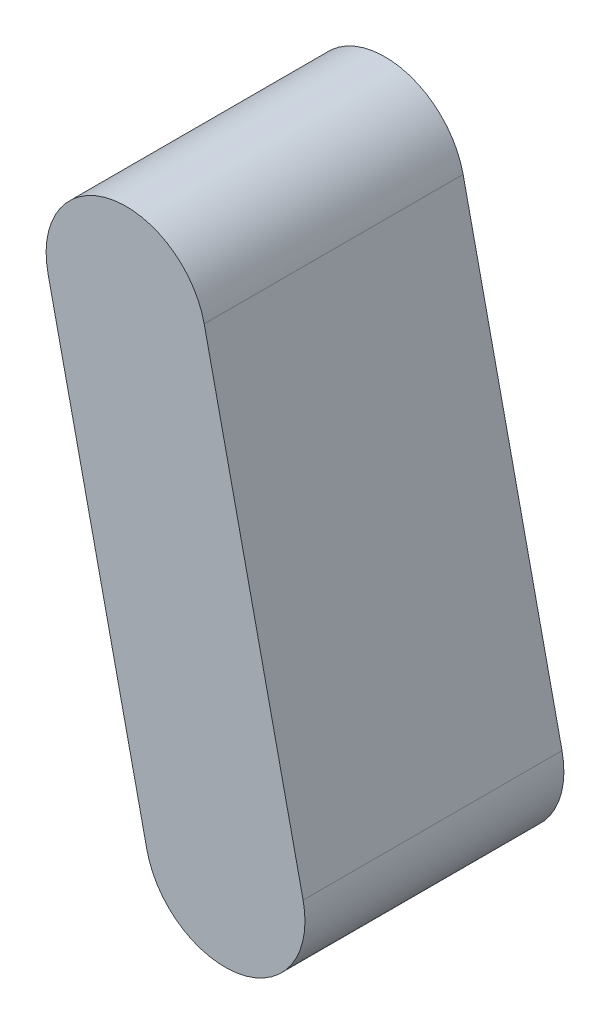
ISO-10303-21;
HEADER;
FILE_DESCRIPTION(('STEP AP214'),'2;1');
FILE_NAME('part.step','',(''),(''),'','','');
FILE_SCHEMA(('AUTOMOTIVE_DESIGN { 1 0 10303 214 1 1 1 1 }'));
ENDSEC;
DATA;
#1=APPLICATION_CONTEXT('core data for automotive mechanical design processes');
#2=APPLICATION_PROTOCOL_DEFINITION('international standard','automotive_design',2000,#1);
#3=PRODUCT_CONTEXT('',#1,'mechanical');
#4=PRODUCT('Part','Part','',(#3));
#5=PRODUCT_RELATED_PRODUCT_CATEGORY('part','',(#4));
#6=PRODUCT_DEFINITION_FORMATION('','',#4);
#7=PRODUCT_DEFINITION_CONTEXT('part definition',#1,'design');
#8=PRODUCT_DEFINITION('design','',#6,#7);
#9=PRODUCT_DEFINITION_SHAPE('','',#8);
#10=(LENGTH_UNIT() NAMED_UNIT(*) SI_UNIT(.MILLI.,.METRE.));
#11=(NAMED_UNIT(*) PLANE_ANGLE_UNIT() SI_UNIT($,.RADIAN.));
#12=(NAMED_UNIT(*) SI_UNIT($,.STERADIAN.) SOLID_ANGLE_UNIT());
#13=UNCERTAINTY_MEASURE_WITH_UNIT(LENGTH_MEASURE(1.E-05),#10,'distance_accuracy_value','');
#14=(GEOMETRIC_REPRESENTATION_CONTEXT(3) GLOBAL_UNCERTAINTY_ASSIGNED_CONTEXT((#13)) GLOBAL_UNIT_ASSIGNED_CONTEXT((#10,
#11,#12)) REPRESENTATION_CONTEXT('',''));
#15=CARTESIAN_POINT('',(0.,0.,0.));
#16=DIRECTION('',(0.,0.,1.));
#17=DIRECTION('',(1.,0.,0.));
#18=AXIS2_PLACEMENT_3D('',#15,#16,#17);
#19=CARTESIAN_POINT('',(-2002.08846798473,389.696157082044,-406.626449965341));
#20=DIRECTION('',(0.,0.,1.));
#21=DIRECTION('',(1.,0.,0.));
#22=AXIS2_PLACEMENT_3D('',#19,#20,#21);
#23=CYLINDRICAL_SURFACE('',#22,35.3059999999997);
#24=DIRECTION('',(0.,0.,1.));
#25=VECTOR('',#24,1.);
#26=CARTESIAN_POINT('',(-1967.60708858418,397.28220418412,-406.626449965341));
#27=LINE('',#26,#25);
#28=CARTESIAN_POINT('',(-1967.60708858418,397.28220418412,-114.3));
#29=VERTEX_POINT('',#28);
#30=CARTESIAN_POINT('',(-1967.60708858418,397.28220418412,0.));
#31=VERTEX_POINT('',#30);
#32=EDGE_CURVE('E99',#29,#31,#27,.T.);
#33=ORIENTED_EDGE('',*,*,#32,.F.);
#34=CARTESIAN_POINT('',(-2002.08846798473,389.696157082044,-114.3));
#35=DIRECTION('',(0.,0.,1.));
#36=DIRECTION('',(1.,0.,0.));
#37=AXIS2_PLACEMENT_3D('',#34,#35,#36);
#38=CIRCLE('',#37,35.3059999999997);
#39=CARTESIAN_POINT('',(-2036.56984738529,382.110109979969,-114.3));
#40=VERTEX_POINT('',#39);
#41=EDGE_CURVE('E44',#29,#40,#38,.T.);
#42=ORIENTED_EDGE('',*,*,#41,.T.);
#43=DIRECTION('',(0.,0.,1.));
#44=VECTOR('',#43,1.);
#45=CARTESIAN_POINT('',(-2036.56984738529,382.110109979969,-406.626449965341));
#46=LINE('',#45,#44);
#47=CARTESIAN_POINT('',(-2036.56984738529,382.110109979969,0.));
#48=VERTEX_POINT('',#47);
#49=EDGE_CURVE('E74',#40,#48,#46,.T.);
#50=ORIENTED_EDGE('',*,*,#49,.T.);
#51=CARTESIAN_POINT('',(-2002.08846798473,389.696157082044,0.));
#52=DIRECTION('',(0.,0.,1.));
#53=DIRECTION('',(1.,0.,0.));
#54=AXIS2_PLACEMENT_3D('',#51,#52,#53);
#55=CIRCLE('',#54,35.3059999999997);
#56=EDGE_CURVE('E77',#48,#31,#55,.F.);
#57=ORIENTED_EDGE('',*,*,#56,.T.);
#58=EDGE_LOOP('',(#33,#42,#50,#57));
#59=FACE_BOUND('',#58,.T.);
#60=ADVANCED_FACE('F37',(#59),#23,.T.);
#61=CARTESIAN_POINT('',(-1793.39952471786,-394.555365935578,-406.626449965341));
#62=DIRECTION('',(-0.976643612999377,-0.214865663118896,0.));
#63=DIRECTION('',(0.214865663118896,-0.976643612999377,0.));
#64=AXIS2_PLACEMENT_3D('',#61,#62,#63);
#65=PLANE('',#64);
#66=DIRECTION('',(0.,0.,1.));
#67=VECTOR('',#66,1.);
#68=CARTESIAN_POINT('',(-1923.94638583842,198.828222022646,-406.626449965341));
#69=LINE('',#68,#67);
#70=CARTESIAN_POINT('',(-1923.94638583842,198.828222022646,-114.3));
#71=VERTEX_POINT('',#70);
#72=CARTESIAN_POINT('',(-1923.94638583842,198.828222022646,0.));
#73=VERTEX_POINT('',#72);
#74=EDGE_CURVE('E102',#71,#73,#69,.T.);
#75=ORIENTED_EDGE('',*,*,#74,.F.);
#76=DIRECTION('',(-0.214865663118896,0.976643612999377,0.));
#77=VECTOR('',#76,1.);
#78=CARTESIAN_POINT('',(-1793.39952471786,-394.555365935578,-114.3));
#79=LINE('',#78,#77);
#80=EDGE_CURVE('E51',#71,#29,#79,.T.);
#81=ORIENTED_EDGE('',*,*,#80,.T.);
#82=ORIENTED_EDGE('',*,*,#32,.T.);
#83=DIRECTION('',(0.214865663118896,-0.976643612999377,0.));
#84=VECTOR('',#83,1.);
#85=CARTESIAN_POINT('',(-1793.39952471786,-394.555365935578,0.));
#86=LINE('',#85,#84);
#87=EDGE_CURVE('E81',#31,#73,#86,.T.);
#88=ORIENTED_EDGE('',*,*,#87,.T.);
#89=EDGE_LOOP('',(#75,#81,#82,#88));
#90=FACE_BOUND('',#89,.T.);
#91=ADVANCED_FACE('F108',(#90),#65,.F.);
#92=CARTESIAN_POINT('',(-1958.42776523897,191.242174920571,-406.626449965341));
#93=DIRECTION('',(0.,0.,1.));
#94=DIRECTION('',(1.,0.,0.));
#95=AXIS2_PLACEMENT_3D('',#92,#93,#94);
#96=CYLINDRICAL_SURFACE('',#95,35.3059999999999);
#97=CARTESIAN_POINT('',(-1958.42776523897,191.242174920571,-114.3));
#98=DIRECTION('',(0.,0.,1.));
#99=DIRECTION('',(1.,0.,0.));
#100=AXIS2_PLACEMENT_3D('',#97,#98,#99);
#101=CIRCLE('',#100,35.3059999999999);
#102=CARTESIAN_POINT('',(-1992.90914463953,183.656127818495,-114.3));
#103=VERTEX_POINT('',#102);
#104=EDGE_CURVE('E101',#71,#103,#101,.F.);
#105=ORIENTED_EDGE('',*,*,#104,.F.);
#106=ORIENTED_EDGE('',*,*,#74,.T.);
#107=CARTESIAN_POINT('',(-1958.42776523897,191.242174920571,0.));
#108=DIRECTION('',(0.,0.,1.));
#109=DIRECTION('',(1.,0.,0.));
#110=AXIS2_PLACEMENT_3D('',#107,#108,#109);
#111=CIRCLE('',#110,35.3059999999999);
#112=CARTESIAN_POINT('',(-1992.90914463953,183.656127818495,0.));
#113=VERTEX_POINT('',#112);
#114=EDGE_CURVE('E93',#113,#73,#111,.T.);
#115=ORIENTED_EDGE('',*,*,#114,.F.);
#116=DIRECTION('',(0.,0.,1.));
#117=VECTOR('',#116,1.);
#118=CARTESIAN_POINT('',(-1992.90914463953,183.656127818495,-406.626449965341));
#119=LINE('',#118,#117);
#120=EDGE_CURVE('E80',#103,#113,#119,.T.);
#121=ORIENTED_EDGE('',*,*,#120,.F.);
#122=EDGE_LOOP('',(#105,#106,#115,#121));
#123=FACE_BOUND('',#122,.T.);
#124=ADVANCED_FACE('F106',(#123),#96,.T.);
#125=CARTESIAN_POINT('',(-1862.36228351897,-409.727460139726,-406.626449965341));
#126=DIRECTION('',(-0.976643612999378,-0.214865663118894,0.));
#127=DIRECTION('',(0.214865663118894,-0.976643612999378,0.));
#128=AXIS2_PLACEMENT_3D('',#125,#126,#127);
#129=PLANE('',#128);
#130=DIRECTION('',(-0.214865663118894,0.976643612999378,0.));
#131=VECTOR('',#130,1.);
#132=CARTESIAN_POINT('',(-1862.36228351897,-409.727460139726,-114.3));
#133=LINE('',#132,#131);
#134=EDGE_CURVE('E11',#103,#40,#133,.T.);
#135=ORIENTED_EDGE('',*,*,#134,.F.);
#136=ORIENTED_EDGE('',*,*,#120,.T.);
#137=DIRECTION('',(0.214865663118894,-0.976643612999378,0.));
#138=VECTOR('',#137,1.);
#139=CARTESIAN_POINT('',(-1862.36228351897,-409.727460139726,0.));
#140=LINE('',#139,#138);
#141=EDGE_CURVE('E87',#48,#113,#140,.T.);
#142=ORIENTED_EDGE('',*,*,#141,.F.);
#143=ORIENTED_EDGE('',*,*,#49,.F.);
#144=EDGE_LOOP('',(#135,#136,#142,#143));
#145=FACE_BOUND('',#144,.T.);
#146=ADVANCED_FACE('F90',(#145),#129,.T.);
#147=CARTESIAN_POINT('',(0.,0.,0.));
#148=DIRECTION('',(0.,0.,1.));
#149=DIRECTION('',(1.,0.,0.));
#150=AXIS2_PLACEMENT_3D('',#147,#148,#149);
#151=PLANE('',#150);
#152=ORIENTED_EDGE('',*,*,#56,.F.);
#153=ORIENTED_EDGE('',*,*,#141,.T.);
#154=ORIENTED_EDGE('',*,*,#114,.T.);
#155=ORIENTED_EDGE('',*,*,#87,.F.);
#156=EDGE_LOOP('',(#152,#153,#154,#155));
#157=FACE_BOUND('',#156,.T.);
#158=ADVANCED_FACE('F85',(#157),#151,.T.);
#159=CARTESIAN_POINT('',(0.,0.,-114.3));
#160=DIRECTION('',(0.,0.,1.));
#161=DIRECTION('',(1.,0.,0.));
#162=AXIS2_PLACEMENT_3D('',#159,#160,#161);
#163=PLANE('',#162);
#164=ORIENTED_EDGE('',*,*,#80,.F.);
#165=ORIENTED_EDGE('',*,*,#104,.T.);
#166=ORIENTED_EDGE('',*,*,#134,.T.);
#167=ORIENTED_EDGE('',*,*,#41,.F.);
#168=EDGE_LOOP('',(#164,#165,#166,#167));
#169=FACE_BOUND('',#168,.T.);
#170=ADVANCED_FACE('F111',(#169),#163,.F.);
#171=CLOSED_SHELL('',(#60,#91,#124,#146,#158,#170));
#172=MANIFOLD_SOLID_BREP('B2',#171);
#173=ADVANCED_BREP_SHAPE_REPRESENTATION('',(#18,#172),#14);
#174=SHAPE_DEFINITION_REPRESENTATION(#9,#173);
ENDSEC;
END-ISO-10303-21;
